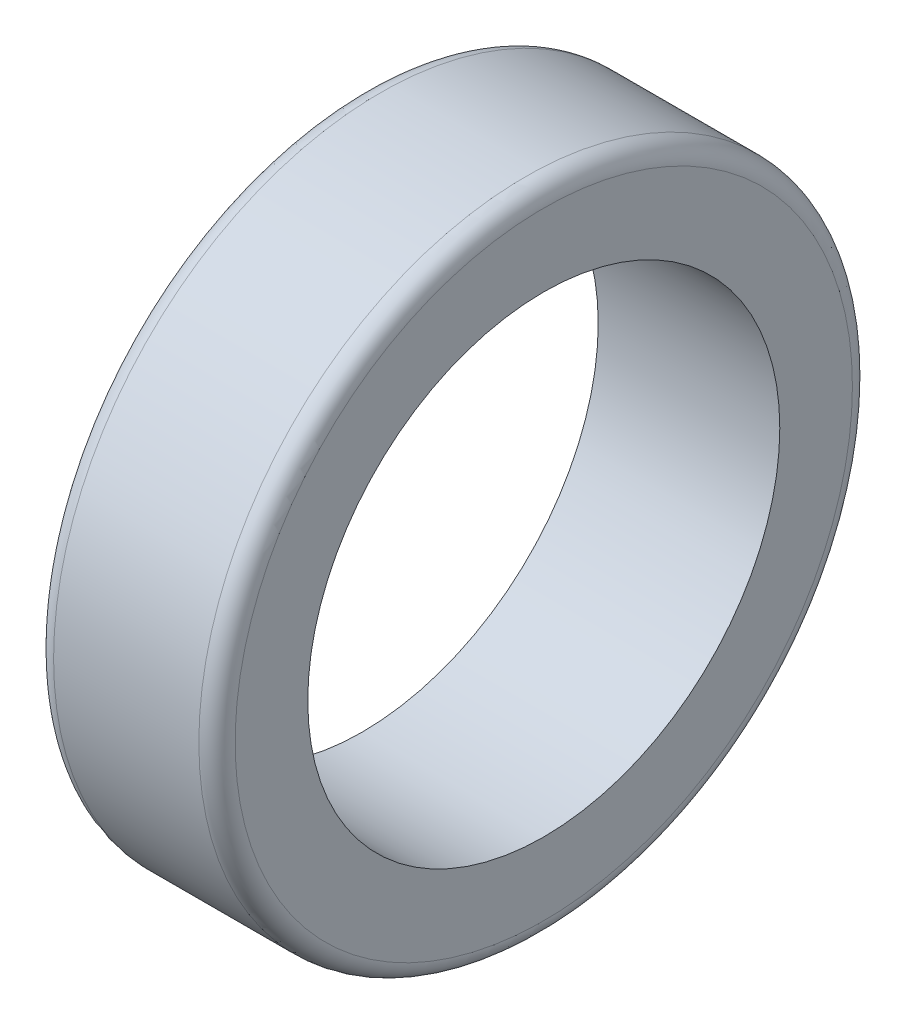
ISO-10303-21;
HEADER;
FILE_DESCRIPTION(('STEP AP214'),'2;1');
FILE_NAME('part.step','',(''),(''),'','','');
FILE_SCHEMA(('AUTOMOTIVE_DESIGN { 1 0 10303 214 1 1 1 1 }'));
ENDSEC;
DATA;
#1=APPLICATION_CONTEXT('core data for automotive mechanical design processes');
#2=APPLICATION_PROTOCOL_DEFINITION('international standard','automotive_design',2000,#1);
#3=PRODUCT_CONTEXT('',#1,'mechanical');
#4=PRODUCT('Part','Part','',(#3));
#5=PRODUCT_RELATED_PRODUCT_CATEGORY('part','',(#4));
#6=PRODUCT_DEFINITION_FORMATION('','',#4);
#7=PRODUCT_DEFINITION_CONTEXT('part definition',#1,'design');
#8=PRODUCT_DEFINITION('design','',#6,#7);
#9=PRODUCT_DEFINITION_SHAPE('','',#8);
#10=(LENGTH_UNIT() NAMED_UNIT(*) SI_UNIT(.MILLI.,.METRE.));
#11=(NAMED_UNIT(*) PLANE_ANGLE_UNIT() SI_UNIT($,.RADIAN.));
#12=(NAMED_UNIT(*) SI_UNIT($,.STERADIAN.) SOLID_ANGLE_UNIT());
#13=UNCERTAINTY_MEASURE_WITH_UNIT(LENGTH_MEASURE(1.E-05),#10,'distance_accuracy_value','');
#14=(GEOMETRIC_REPRESENTATION_CONTEXT(3) GLOBAL_UNCERTAINTY_ASSIGNED_CONTEXT((#13)) GLOBAL_UNIT_ASSIGNED_CONTEXT((#10,
#11,#12)) REPRESENTATION_CONTEXT('',''));
#15=CARTESIAN_POINT('',(0.,0.,0.));
#16=DIRECTION('',(0.,0.,1.));
#17=DIRECTION('',(1.,0.,0.));
#18=AXIS2_PLACEMENT_3D('',#15,#16,#17);
#19=CARTESIAN_POINT('',(25.,-45.,0.));
#20=DIRECTION('',(1.,0.,0.));
#21=DIRECTION('',(0.,0.,-1.));
#22=AXIS2_PLACEMENT_3D('',#19,#20,#21);
#23=PLANE('',#22);
#24=CARTESIAN_POINT('',(25.,-45.,0.));
#25=DIRECTION('',(1.,0.,0.));
#26=DIRECTION('',(0.,0.,-1.));
#27=AXIS2_PLACEMENT_3D('',#24,#25,#26);
#28=CIRCLE('',#27,65.);
#29=CARTESIAN_POINT('',(25.,-45.,-65.));
#30=VERTEX_POINT('',#29);
#31=EDGE_CURVE('E50',#30,#30,#28,.T.);
#32=ORIENTED_EDGE('',*,*,#31,.F.);
#33=EDGE_LOOP('',(#32));
#34=FACE_BOUND('',#33,.T.);
#35=CARTESIAN_POINT('',(25.,-45.,0.));
#36=DIRECTION('',(1.,0.,0.));
#37=DIRECTION('',(0.,0.,-1.));
#38=AXIS2_PLACEMENT_3D('',#35,#36,#37);
#39=CIRCLE('',#38,85.);
#40=CARTESIAN_POINT('',(25.,-45.,-85.));
#41=VERTEX_POINT('',#40);
#42=EDGE_CURVE('E10',#41,#41,#39,.T.);
#43=ORIENTED_EDGE('',*,*,#42,.T.);
#44=EDGE_LOOP('',(#43));
#45=FACE_BOUND('',#44,.T.);
#46=ADVANCED_FACE('F30',(#34,#45),#23,.T.);
#47=CARTESIAN_POINT('',(20.,-45.,0.));
#48=DIRECTION('',(1.,0.,0.));
#49=DIRECTION('',(0.,0.,-1.));
#50=AXIS2_PLACEMENT_3D('',#47,#48,#49);
#51=TOROIDAL_SURFACE('',#50,85.,5.);
#52=CARTESIAN_POINT('',(20.,-45.,0.));
#53=DIRECTION('',(1.,0.,0.));
#54=DIRECTION('',(0.,0.,-1.));
#55=AXIS2_PLACEMENT_3D('',#52,#53,#54);
#56=CIRCLE('',#55,90.);
#57=CARTESIAN_POINT('',(20.,-45.,-90.));
#58=VERTEX_POINT('',#57);
#59=EDGE_CURVE('E36',#58,#58,#56,.T.);
#60=ORIENTED_EDGE('',*,*,#59,.T.);
#61=EDGE_LOOP('',(#60));
#62=FACE_BOUND('',#61,.T.);
#63=ORIENTED_EDGE('',*,*,#42,.F.);
#64=EDGE_LOOP('',(#63));
#65=FACE_BOUND('',#64,.T.);
#66=ADVANCED_FACE('F66',(#62,#65),#51,.T.);
#67=CARTESIAN_POINT('',(25.,-45.,0.));
#68=DIRECTION('',(1.,0.,0.));
#69=DIRECTION('',(0.,0.,-1.));
#70=AXIS2_PLACEMENT_3D('',#67,#68,#69);
#71=CYLINDRICAL_SURFACE('',#70,90.);
#72=CARTESIAN_POINT('',(-20.,-45.,0.));
#73=DIRECTION('',(1.,0.,0.));
#74=DIRECTION('',(0.,0.,-1.));
#75=AXIS2_PLACEMENT_3D('',#72,#73,#74);
#76=CIRCLE('',#75,90.);
#77=CARTESIAN_POINT('',(-20.,-45.,-90.));
#78=VERTEX_POINT('',#77);
#79=EDGE_CURVE('E40',#78,#78,#76,.T.);
#80=ORIENTED_EDGE('',*,*,#79,.T.);
#81=EDGE_LOOP('',(#80));
#82=FACE_BOUND('',#81,.T.);
#83=ORIENTED_EDGE('',*,*,#59,.F.);
#84=EDGE_LOOP('',(#83));
#85=FACE_BOUND('',#84,.T.);
#86=ADVANCED_FACE('F70',(#82,#85),#71,.T.);
#87=CARTESIAN_POINT('',(-20.,-45.,0.));
#88=DIRECTION('',(1.,0.,0.));
#89=DIRECTION('',(0.,0.,-1.));
#90=AXIS2_PLACEMENT_3D('',#87,#88,#89);
#91=TOROIDAL_SURFACE('',#90,85.,5.);
#92=CARTESIAN_POINT('',(-25.,-45.,0.));
#93=DIRECTION('',(1.,0.,0.));
#94=DIRECTION('',(0.,0.,-1.));
#95=AXIS2_PLACEMENT_3D('',#92,#93,#94);
#96=CIRCLE('',#95,85.);
#97=CARTESIAN_POINT('',(-25.,-45.,-85.));
#98=VERTEX_POINT('',#97);
#99=EDGE_CURVE('E44',#98,#98,#96,.T.);
#100=ORIENTED_EDGE('',*,*,#99,.T.);
#101=EDGE_LOOP('',(#100));
#102=FACE_BOUND('',#101,.T.);
#103=ORIENTED_EDGE('',*,*,#79,.F.);
#104=EDGE_LOOP('',(#103));
#105=FACE_BOUND('',#104,.T.);
#106=ADVANCED_FACE('F74',(#102,#105),#91,.T.);
#107=CARTESIAN_POINT('',(-25.,-45.,0.));
#108=DIRECTION('',(-1.,0.,0.));
#109=DIRECTION('',(0.,0.,1.));
#110=AXIS2_PLACEMENT_3D('',#107,#108,#109);
#111=PLANE('',#110);
#112=CARTESIAN_POINT('',(-25.,-45.,0.));
#113=DIRECTION('',(1.,0.,0.));
#114=DIRECTION('',(0.,0.,-1.));
#115=AXIS2_PLACEMENT_3D('',#112,#113,#114);
#116=CIRCLE('',#115,65.);
#117=CARTESIAN_POINT('',(-25.,-45.,-65.));
#118=VERTEX_POINT('',#117);
#119=EDGE_CURVE('E49',#118,#118,#116,.T.);
#120=ORIENTED_EDGE('',*,*,#119,.T.);
#121=EDGE_LOOP('',(#120));
#122=FACE_BOUND('',#121,.T.);
#123=ORIENTED_EDGE('',*,*,#99,.F.);
#124=EDGE_LOOP('',(#123));
#125=FACE_BOUND('',#124,.T.);
#126=ADVANCED_FACE('F56',(#122,#125),#111,.T.);
#127=CARTESIAN_POINT('',(-25.,-45.,0.));
#128=DIRECTION('',(1.,0.,0.));
#129=DIRECTION('',(0.,0.,-1.));
#130=AXIS2_PLACEMENT_3D('',#127,#128,#129);
#131=CYLINDRICAL_SURFACE('',#130,65.);
#132=ORIENTED_EDGE('',*,*,#119,.F.);
#133=EDGE_LOOP('',(#132));
#134=FACE_BOUND('',#133,.T.);
#135=ORIENTED_EDGE('',*,*,#31,.T.);
#136=EDGE_LOOP('',(#135));
#137=FACE_BOUND('',#136,.T.);
#138=ADVANCED_FACE('F59',(#134,#137),#131,.F.);
#139=CLOSED_SHELL('',(#46,#66,#86,#106,#126,#138));
#140=MANIFOLD_SOLID_BREP('B2',#139);
#141=ADVANCED_BREP_SHAPE_REPRESENTATION('',(#18,#140),#14);
#142=SHAPE_DEFINITION_REPRESENTATION(#9,#141);
ENDSEC;
END-ISO-10303-21;
